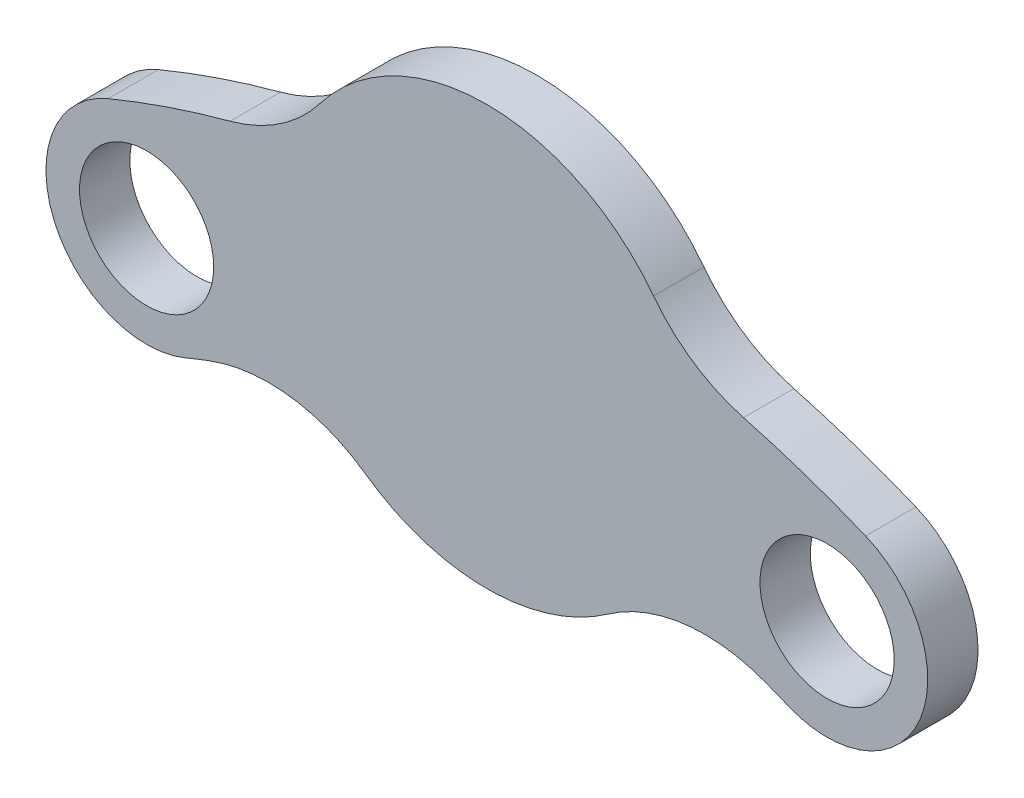
ISO-10303-21;
HEADER;
FILE_DESCRIPTION(('STEP AP214'),'2;1');
FILE_NAME('part.step','',(''),(''),'','','');
FILE_SCHEMA(('AUTOMOTIVE_DESIGN { 1 0 10303 214 1 1 1 1 }'));
ENDSEC;
DATA;
#1=APPLICATION_CONTEXT('core data for automotive mechanical design processes');
#2=APPLICATION_PROTOCOL_DEFINITION('international standard','automotive_design',2000,#1);
#3=PRODUCT_CONTEXT('',#1,'mechanical');
#4=PRODUCT('Part','Part','',(#3));
#5=PRODUCT_RELATED_PRODUCT_CATEGORY('part','',(#4));
#6=PRODUCT_DEFINITION_FORMATION('','',#4);
#7=PRODUCT_DEFINITION_CONTEXT('part definition',#1,'design');
#8=PRODUCT_DEFINITION('design','',#6,#7);
#9=PRODUCT_DEFINITION_SHAPE('','',#8);
#10=(LENGTH_UNIT() NAMED_UNIT(*) SI_UNIT(.MILLI.,.METRE.));
#11=(NAMED_UNIT(*) PLANE_ANGLE_UNIT() SI_UNIT($,.RADIAN.));
#12=(NAMED_UNIT(*) SI_UNIT($,.STERADIAN.) SOLID_ANGLE_UNIT());
#13=UNCERTAINTY_MEASURE_WITH_UNIT(LENGTH_MEASURE(1.E-05),#10,'distance_accuracy_value','');
#14=(GEOMETRIC_REPRESENTATION_CONTEXT(3) GLOBAL_UNCERTAINTY_ASSIGNED_CONTEXT((#13)) GLOBAL_UNIT_ASSIGNED_CONTEXT((#10,
#11,#12)) REPRESENTATION_CONTEXT('',''));
#15=CARTESIAN_POINT('',(0.,0.,0.));
#16=DIRECTION('',(0.,0.,1.));
#17=DIRECTION('',(1.,0.,0.));
#18=AXIS2_PLACEMENT_3D('',#15,#16,#17);
#19=CARTESIAN_POINT('',(0.,13.25,1.5));
#20=DIRECTION('',(0.,0.,1.));
#21=DIRECTION('',(1.,0.,0.));
#22=AXIS2_PLACEMENT_3D('',#19,#20,#21);
#23=PLANE('',#22);
#24=CARTESIAN_POINT('',(-10.1411109576752,24.4828076115472,1.5));
#25=DIRECTION('',(0.,0.,1.));
#26=DIRECTION('',(1.,0.,0.));
#27=AXIS2_PLACEMENT_3D('',#24,#25,#26);
#28=CIRCLE('',#27,2.);
#29=CARTESIAN_POINT('',(-8.14111095767523,24.4828076115472,1.5));
#30=VERTEX_POINT('',#29);
#31=EDGE_CURVE('E165',#30,#30,#28,.T.);
#32=ORIENTED_EDGE('',*,*,#31,.F.);
#33=EDGE_LOOP('',(#32));
#34=FACE_BOUND('',#33,.T.);
#35=CARTESIAN_POINT('',(0.,0.,1.5));
#36=DIRECTION('',(0.,0.,1.));
#37=DIRECTION('',(1.,0.,0.));
#38=AXIS2_PLACEMENT_3D('',#35,#36,#37);
#39=CIRCLE('',#38,29.4999999999983);
#40=CARTESIAN_POINT('',(11.2891612547697,27.2544462090831,1.5));
#41=VERTEX_POINT('',#40);
#42=CARTESIAN_POINT('',(7.65067171290921,28.4906514902905,1.5));
#43=VERTEX_POINT('',#42);
#44=EDGE_CURVE('E159',#41,#43,#39,.T.);
#45=ORIENTED_EDGE('',*,*,#44,.T.);
#46=CARTESIAN_POINT('',(8.94739573204644,33.319575471696,1.5));
#47=DIRECTION('',(0.,0.,1.));
#48=DIRECTION('',(1.,0.,0.));
#49=AXIS2_PLACEMENT_3D('',#46,#47,#48);
#50=CIRCLE('',#49,5.);
#51=CARTESIAN_POINT('',(4.97077540669247,30.2886530398311,1.5));
#52=VERTEX_POINT('',#51);
#53=EDGE_CURVE('E207',#43,#52,#50,.F.);
#54=ORIENTED_EDGE('',*,*,#53,.T.);
#55=CARTESIAN_POINT('',(0.,26.5,1.5));
#56=DIRECTION('',(0.,0.,1.));
#57=DIRECTION('',(1.,0.,0.));
#58=AXIS2_PLACEMENT_3D('',#55,#56,#57);
#59=CIRCLE('',#58,6.25);
#60=CARTESIAN_POINT('',(-4.97077540669246,30.2886530398311,1.5));
#61=VERTEX_POINT('',#60);
#62=EDGE_CURVE('E133',#52,#61,#59,.T.);
#63=ORIENTED_EDGE('',*,*,#62,.T.);
#64=CARTESIAN_POINT('',(-8.94739573204641,33.319575471696,1.5));
#65=DIRECTION('',(0.,0.,1.));
#66=DIRECTION('',(1.,0.,0.));
#67=AXIS2_PLACEMENT_3D('',#64,#65,#66);
#68=CIRCLE('',#67,5.);
#69=CARTESIAN_POINT('',(-7.65067171290919,28.4906514902905,1.5));
#70=VERTEX_POINT('',#69);
#71=EDGE_CURVE('E129',#61,#70,#68,.F.);
#72=ORIENTED_EDGE('',*,*,#71,.T.);
#73=CARTESIAN_POINT('',(0.,0.,1.5));
#74=DIRECTION('',(0.,0.,1.));
#75=DIRECTION('',(1.,0.,0.));
#76=AXIS2_PLACEMENT_3D('',#73,#74,#75);
#77=CIRCLE('',#76,29.4999999999983);
#78=CARTESIAN_POINT('',(-11.2891612547706,27.254446209081,1.5));
#79=VERTEX_POINT('',#78);
#80=EDGE_CURVE('E119',#70,#79,#77,.T.);
#81=ORIENTED_EDGE('',*,*,#80,.T.);
#82=CARTESIAN_POINT('',(-10.1411109576752,24.4828076115472,1.5));
#83=DIRECTION('',(0.,0.,1.));
#84=DIRECTION('',(1.,0.,0.));
#85=AXIS2_PLACEMENT_3D('',#82,#83,#84);
#86=CIRCLE('',#85,3.);
#87=CARTESIAN_POINT('',(-8.99306066057985,21.7111690140134,1.5));
#88=VERTEX_POINT('',#87);
#89=EDGE_CURVE('E125',#79,#88,#86,.T.);
#90=ORIENTED_EDGE('',*,*,#89,.T.);
#91=CARTESIAN_POINT('',(0.,0.,1.5));
#92=DIRECTION('',(0.,0.,-1.));
#93=DIRECTION('',(1.,0.,0.));
#94=AXIS2_PLACEMENT_3D('',#91,#92,#93);
#95=CIRCLE('',#94,23.4999999999983);
#96=CARTESIAN_POINT('',(-8.25991282210598,22.0005418153993,1.5));
#97=VERTEX_POINT('',#96);
#98=EDGE_CURVE('E148',#88,#97,#95,.T.);
#99=ORIENTED_EDGE('',*,*,#98,.T.);
#100=CARTESIAN_POINT('',(-6.50248456208331,17.319575471697,1.5));
#101=DIRECTION('',(0.,0.,1.));
#102=DIRECTION('',(1.,0.,0.));
#103=AXIS2_PLACEMENT_3D('',#100,#101,#102);
#104=CIRCLE('',#103,5.);
#105=CARTESIAN_POINT('',(-3.61249142337962,21.3997641509428,1.5));
#106=VERTEX_POINT('',#105);
#107=EDGE_CURVE('E214',#97,#106,#104,.F.);
#108=ORIENTED_EDGE('',*,*,#107,.T.);
#109=CARTESIAN_POINT('',(0.,26.5,1.5));
#110=DIRECTION('',(0.,0.,1.));
#111=DIRECTION('',(1.,0.,0.));
#112=AXIS2_PLACEMENT_3D('',#109,#110,#111);
#113=CIRCLE('',#112,6.25);
#114=CARTESIAN_POINT('',(3.61249142337962,21.3997641509428,1.5));
#115=VERTEX_POINT('',#114);
#116=EDGE_CURVE('E150',#106,#115,#113,.T.);
#117=ORIENTED_EDGE('',*,*,#116,.T.);
#118=CARTESIAN_POINT('',(6.50248456208331,17.319575471697,1.5));
#119=DIRECTION('',(0.,0.,1.));
#120=DIRECTION('',(1.,0.,0.));
#121=AXIS2_PLACEMENT_3D('',#118,#119,#120);
#122=CIRCLE('',#121,5.);
#123=CARTESIAN_POINT('',(8.25991282210598,22.0005418153993,1.5));
#124=VERTEX_POINT('',#123);
#125=EDGE_CURVE('E11',#115,#124,#122,.F.);
#126=ORIENTED_EDGE('',*,*,#125,.T.);
#127=CARTESIAN_POINT('',(0.,0.,1.5));
#128=DIRECTION('',(0.,0.,-1.));
#129=DIRECTION('',(1.,0.,0.));
#130=AXIS2_PLACEMENT_3D('',#127,#128,#129);
#131=CIRCLE('',#130,23.4999999999983);
#132=CARTESIAN_POINT('',(8.99306066057865,21.7111690140138,1.5));
#133=VERTEX_POINT('',#132);
#134=EDGE_CURVE('E155',#124,#133,#131,.T.);
#135=ORIENTED_EDGE('',*,*,#134,.T.);
#136=CARTESIAN_POINT('',(10.1411109576745,24.4828076115492,1.5));
#137=DIRECTION('',(0.,0.,1.));
#138=DIRECTION('',(1.,0.,0.));
#139=AXIS2_PLACEMENT_3D('',#136,#137,#138);
#140=CIRCLE('',#139,3.);
#141=EDGE_CURVE('E157',#133,#41,#140,.T.);
#142=ORIENTED_EDGE('',*,*,#141,.T.);
#143=EDGE_LOOP('',(#45,#54,#63,#72,#81,#90,#99,#108,#117,#126,#135,#142));
#144=FACE_BOUND('',#143,.T.);
#145=CARTESIAN_POINT('',(10.1411109576745,24.4828076115492,1.5));
#146=DIRECTION('',(0.,0.,1.));
#147=DIRECTION('',(1.,0.,0.));
#148=AXIS2_PLACEMENT_3D('',#145,#146,#147);
#149=CIRCLE('',#148,2.);
#150=CARTESIAN_POINT('',(12.1411109576745,24.4828076115492,1.5));
#151=VERTEX_POINT('',#150);
#152=EDGE_CURVE('E250',#151,#151,#149,.T.);
#153=ORIENTED_EDGE('',*,*,#152,.F.);
#154=EDGE_LOOP('',(#153));
#155=FACE_BOUND('',#154,.T.);
#156=ADVANCED_FACE('F33',(#34,#144,#155),#23,.T.);
#157=CARTESIAN_POINT('',(0.,13.25,0.));
#158=DIRECTION('',(0.,0.,1.));
#159=DIRECTION('',(1.,0.,0.));
#160=AXIS2_PLACEMENT_3D('',#157,#158,#159);
#161=PLANE('',#160);
#162=CARTESIAN_POINT('',(-10.1411109576752,24.4828076115472,0.));
#163=DIRECTION('',(0.,0.,1.));
#164=DIRECTION('',(1.,0.,0.));
#165=AXIS2_PLACEMENT_3D('',#162,#163,#164);
#166=CIRCLE('',#165,2.);
#167=CARTESIAN_POINT('',(-8.14111095767523,24.4828076115472,0.));
#168=VERTEX_POINT('',#167);
#169=EDGE_CURVE('E247',#168,#168,#166,.T.);
#170=ORIENTED_EDGE('',*,*,#169,.T.);
#171=EDGE_LOOP('',(#170));
#172=FACE_BOUND('',#171,.T.);
#173=CARTESIAN_POINT('',(0.,26.5,0.));
#174=DIRECTION('',(0.,0.,1.));
#175=DIRECTION('',(1.,0.,0.));
#176=AXIS2_PLACEMENT_3D('',#173,#174,#175);
#177=CIRCLE('',#176,6.25);
#178=CARTESIAN_POINT('',(4.97077540669247,30.2886530398311,0.));
#179=VERTEX_POINT('',#178);
#180=CARTESIAN_POINT('',(-4.97077540669246,30.2886530398311,0.));
#181=VERTEX_POINT('',#180);
#182=EDGE_CURVE('E162',#179,#181,#177,.T.);
#183=ORIENTED_EDGE('',*,*,#182,.F.);
#184=CARTESIAN_POINT('',(8.94739573204644,33.319575471696,0.));
#185=DIRECTION('',(0.,0.,1.));
#186=DIRECTION('',(1.,0.,0.));
#187=AXIS2_PLACEMENT_3D('',#184,#185,#186);
#188=CIRCLE('',#187,5.);
#189=CARTESIAN_POINT('',(7.65067171290921,28.4906514902905,0.));
#190=VERTEX_POINT('',#189);
#191=EDGE_CURVE('E205',#179,#190,#188,.T.);
#192=ORIENTED_EDGE('',*,*,#191,.T.);
#193=CARTESIAN_POINT('',(0.,0.,0.));
#194=DIRECTION('',(0.,0.,1.));
#195=DIRECTION('',(1.,0.,0.));
#196=AXIS2_PLACEMENT_3D('',#193,#194,#195);
#197=CIRCLE('',#196,29.4999999999983);
#198=CARTESIAN_POINT('',(11.2891612547697,27.2544462090831,0.));
#199=VERTEX_POINT('',#198);
#200=EDGE_CURVE('E179',#199,#190,#197,.T.);
#201=ORIENTED_EDGE('',*,*,#200,.F.);
#202=CARTESIAN_POINT('',(10.1411109576745,24.4828076115492,0.));
#203=DIRECTION('',(0.,0.,1.));
#204=DIRECTION('',(1.,0.,0.));
#205=AXIS2_PLACEMENT_3D('',#202,#203,#204);
#206=CIRCLE('',#205,3.);
#207=CARTESIAN_POINT('',(8.99306066057865,21.7111690140138,0.));
#208=VERTEX_POINT('',#207);
#209=EDGE_CURVE('E177',#208,#199,#206,.T.);
#210=ORIENTED_EDGE('',*,*,#209,.F.);
#211=CARTESIAN_POINT('',(0.,0.,0.));
#212=DIRECTION('',(0.,0.,-1.));
#213=DIRECTION('',(1.,0.,0.));
#214=AXIS2_PLACEMENT_3D('',#211,#212,#213);
#215=CIRCLE('',#214,23.4999999999983);
#216=CARTESIAN_POINT('',(8.25991282210598,22.0005418153993,0.));
#217=VERTEX_POINT('',#216);
#218=EDGE_CURVE('E175',#217,#208,#215,.T.);
#219=ORIENTED_EDGE('',*,*,#218,.F.);
#220=CARTESIAN_POINT('',(6.50248456208331,17.319575471697,0.));
#221=DIRECTION('',(0.,0.,1.));
#222=DIRECTION('',(1.,0.,0.));
#223=AXIS2_PLACEMENT_3D('',#220,#221,#222);
#224=CIRCLE('',#223,5.);
#225=CARTESIAN_POINT('',(3.61249142337962,21.3997641509428,0.));
#226=VERTEX_POINT('',#225);
#227=EDGE_CURVE('E41',#217,#226,#224,.T.);
#228=ORIENTED_EDGE('',*,*,#227,.T.);
#229=CARTESIAN_POINT('',(0.,26.5,0.));
#230=DIRECTION('',(0.,0.,1.));
#231=DIRECTION('',(1.,0.,0.));
#232=AXIS2_PLACEMENT_3D('',#229,#230,#231);
#233=CIRCLE('',#232,6.25);
#234=CARTESIAN_POINT('',(-3.61249142337962,21.3997641509428,0.));
#235=VERTEX_POINT('',#234);
#236=EDGE_CURVE('E172',#235,#226,#233,.T.);
#237=ORIENTED_EDGE('',*,*,#236,.F.);
#238=CARTESIAN_POINT('',(-6.50248456208331,17.319575471697,0.));
#239=DIRECTION('',(0.,0.,1.));
#240=DIRECTION('',(1.,0.,0.));
#241=AXIS2_PLACEMENT_3D('',#238,#239,#240);
#242=CIRCLE('',#241,5.);
#243=CARTESIAN_POINT('',(-8.25991282210598,22.0005418153993,0.));
#244=VERTEX_POINT('',#243);
#245=EDGE_CURVE('E212',#235,#244,#242,.T.);
#246=ORIENTED_EDGE('',*,*,#245,.T.);
#247=CARTESIAN_POINT('',(0.,0.,0.));
#248=DIRECTION('',(0.,0.,-1.));
#249=DIRECTION('',(1.,0.,0.));
#250=AXIS2_PLACEMENT_3D('',#247,#248,#249);
#251=CIRCLE('',#250,23.4999999999983);
#252=CARTESIAN_POINT('',(-8.99306066057985,21.7111690140134,0.));
#253=VERTEX_POINT('',#252);
#254=EDGE_CURVE('E169',#253,#244,#251,.T.);
#255=ORIENTED_EDGE('',*,*,#254,.F.);
#256=CARTESIAN_POINT('',(-10.1411109576752,24.4828076115472,0.));
#257=DIRECTION('',(0.,0.,1.));
#258=DIRECTION('',(1.,0.,0.));
#259=AXIS2_PLACEMENT_3D('',#256,#257,#258);
#260=CIRCLE('',#259,3.);
#261=CARTESIAN_POINT('',(-11.2891612547706,27.254446209081,0.));
#262=VERTEX_POINT('',#261);
#263=EDGE_CURVE('E167',#262,#253,#260,.T.);
#264=ORIENTED_EDGE('',*,*,#263,.F.);
#265=CARTESIAN_POINT('',(0.,0.,0.));
#266=DIRECTION('',(0.,0.,1.));
#267=DIRECTION('',(1.,0.,0.));
#268=AXIS2_PLACEMENT_3D('',#265,#266,#267);
#269=CIRCLE('',#268,29.4999999999983);
#270=CARTESIAN_POINT('',(-7.65067171290919,28.4906514902905,0.));
#271=VERTEX_POINT('',#270);
#272=EDGE_CURVE('E139',#271,#262,#269,.T.);
#273=ORIENTED_EDGE('',*,*,#272,.F.);
#274=CARTESIAN_POINT('',(-8.94739573204641,33.319575471696,0.));
#275=DIRECTION('',(0.,0.,1.));
#276=DIRECTION('',(1.,0.,0.));
#277=AXIS2_PLACEMENT_3D('',#274,#275,#276);
#278=CIRCLE('',#277,5.);
#279=EDGE_CURVE('E209',#271,#181,#278,.T.);
#280=ORIENTED_EDGE('',*,*,#279,.T.);
#281=EDGE_LOOP('',(#183,#192,#201,#210,#219,#228,#237,#246,#255,#264,#273,#280));
#282=FACE_BOUND('',#281,.T.);
#283=CARTESIAN_POINT('',(10.1411109576745,24.4828076115492,0.));
#284=DIRECTION('',(0.,0.,1.));
#285=DIRECTION('',(1.,0.,0.));
#286=AXIS2_PLACEMENT_3D('',#283,#284,#285);
#287=CIRCLE('',#286,2.);
#288=CARTESIAN_POINT('',(12.1411109576745,24.4828076115492,0.));
#289=VERTEX_POINT('',#288);
#290=EDGE_CURVE('E253',#289,#289,#287,.T.);
#291=ORIENTED_EDGE('',*,*,#290,.T.);
#292=EDGE_LOOP('',(#291));
#293=FACE_BOUND('',#292,.T.);
#294=ADVANCED_FACE('F219',(#172,#282,#293),#161,.F.);
#295=CARTESIAN_POINT('',(0.,26.5,1.5));
#296=DIRECTION('',(0.,0.,-1.));
#297=DIRECTION('',(-1.,0.,0.));
#298=AXIS2_PLACEMENT_3D('',#295,#296,#297);
#299=CYLINDRICAL_SURFACE('',#298,6.25);
#300=ORIENTED_EDGE('',*,*,#62,.F.);
#301=DIRECTION('',(0.,0.,-1.));
#302=VECTOR('',#301,1.);
#303=CARTESIAN_POINT('',(4.97077540669247,30.2886530398311,1.5));
#304=LINE('',#303,#302);
#305=EDGE_CURVE('E189',#52,#179,#304,.T.);
#306=ORIENTED_EDGE('',*,*,#305,.T.);
#307=ORIENTED_EDGE('',*,*,#182,.T.);
#308=DIRECTION('',(0.,0.,-1.));
#309=VECTOR('',#308,1.);
#310=CARTESIAN_POINT('',(-4.97077540669246,30.2886530398311,1.5));
#311=LINE('',#310,#309);
#312=EDGE_CURVE('E142',#181,#61,#311,.F.);
#313=ORIENTED_EDGE('',*,*,#312,.T.);
#314=EDGE_LOOP('',(#300,#306,#307,#313));
#315=FACE_BOUND('',#314,.T.);
#316=ADVANCED_FACE('F244',(#315),#299,.T.);
#317=CARTESIAN_POINT('',(0.,0.,1.5));
#318=DIRECTION('',(0.,0.,-1.));
#319=DIRECTION('',(-1.,0.,0.));
#320=AXIS2_PLACEMENT_3D('',#317,#318,#319);
#321=CYLINDRICAL_SURFACE('',#320,29.4999999999983);
#322=ORIENTED_EDGE('',*,*,#80,.F.);
#323=DIRECTION('',(0.,0.,-1.));
#324=VECTOR('',#323,1.);
#325=CARTESIAN_POINT('',(-7.65067171290919,28.4906514902905,1.5));
#326=LINE('',#325,#324);
#327=EDGE_CURVE('E194',#70,#271,#326,.T.);
#328=ORIENTED_EDGE('',*,*,#327,.T.);
#329=ORIENTED_EDGE('',*,*,#272,.T.);
#330=DIRECTION('',(0.,0.,-1.));
#331=VECTOR('',#330,1.);
#332=CARTESIAN_POINT('',(-11.2891612547706,27.254446209081,1.5));
#333=LINE('',#332,#331);
#334=EDGE_CURVE('E136',#79,#262,#333,.T.);
#335=ORIENTED_EDGE('',*,*,#334,.F.);
#336=EDGE_LOOP('',(#322,#328,#329,#335));
#337=FACE_BOUND('',#336,.T.);
#338=ADVANCED_FACE('F137',(#337),#321,.T.);
#339=CARTESIAN_POINT('',(-10.1411109576752,24.4828076115472,1.5));
#340=DIRECTION('',(0.,0.,-1.));
#341=DIRECTION('',(-1.,0.,0.));
#342=AXIS2_PLACEMENT_3D('',#339,#340,#341);
#343=CYLINDRICAL_SURFACE('',#342,3.);
#344=ORIENTED_EDGE('',*,*,#263,.T.);
#345=DIRECTION('',(0.,0.,-1.));
#346=VECTOR('',#345,1.);
#347=CARTESIAN_POINT('',(-8.99306066057985,21.7111690140134,1.5));
#348=LINE('',#347,#346);
#349=EDGE_CURVE('E143',#88,#253,#348,.T.);
#350=ORIENTED_EDGE('',*,*,#349,.F.);
#351=ORIENTED_EDGE('',*,*,#89,.F.);
#352=ORIENTED_EDGE('',*,*,#334,.T.);
#353=EDGE_LOOP('',(#344,#350,#351,#352));
#354=FACE_BOUND('',#353,.T.);
#355=ADVANCED_FACE('F145',(#354),#343,.T.);
#356=CARTESIAN_POINT('',(0.,0.,1.5));
#357=DIRECTION('',(0.,0.,-1.));
#358=DIRECTION('',(-1.,0.,0.));
#359=AXIS2_PLACEMENT_3D('',#356,#357,#358);
#360=CYLINDRICAL_SURFACE('',#359,23.4999999999983);
#361=ORIENTED_EDGE('',*,*,#254,.T.);
#362=DIRECTION('',(0.,0.,-1.));
#363=VECTOR('',#362,1.);
#364=CARTESIAN_POINT('',(-8.25991282210598,22.0005418153993,1.5));
#365=LINE('',#364,#363);
#366=EDGE_CURVE('E201',#244,#97,#365,.F.);
#367=ORIENTED_EDGE('',*,*,#366,.T.);
#368=ORIENTED_EDGE('',*,*,#98,.F.);
#369=ORIENTED_EDGE('',*,*,#349,.T.);
#370=EDGE_LOOP('',(#361,#367,#368,#369));
#371=FACE_BOUND('',#370,.T.);
#372=ADVANCED_FACE('F282',(#371),#360,.F.);
#373=CARTESIAN_POINT('',(0.,26.5,1.5));
#374=DIRECTION('',(0.,0.,-1.));
#375=DIRECTION('',(-1.,0.,0.));
#376=AXIS2_PLACEMENT_3D('',#373,#374,#375);
#377=CYLINDRICAL_SURFACE('',#376,6.25);
#378=ORIENTED_EDGE('',*,*,#116,.F.);
#379=DIRECTION('',(0.,0.,-1.));
#380=VECTOR('',#379,1.);
#381=CARTESIAN_POINT('',(-3.61249142337962,21.3997641509428,1.5));
#382=LINE('',#381,#380);
#383=EDGE_CURVE('E198',#106,#235,#382,.T.);
#384=ORIENTED_EDGE('',*,*,#383,.T.);
#385=ORIENTED_EDGE('',*,*,#236,.T.);
#386=DIRECTION('',(0.,0.,-1.));
#387=VECTOR('',#386,1.);
#388=CARTESIAN_POINT('',(3.61249142337962,21.3997641509428,1.5));
#389=LINE('',#388,#387);
#390=EDGE_CURVE('E196',#226,#115,#389,.F.);
#391=ORIENTED_EDGE('',*,*,#390,.T.);
#392=EDGE_LOOP('',(#378,#384,#385,#391));
#393=FACE_BOUND('',#392,.T.);
#394=ADVANCED_FACE('F224',(#393),#377,.T.);
#395=CARTESIAN_POINT('',(0.,0.,1.5));
#396=DIRECTION('',(0.,0.,-1.));
#397=DIRECTION('',(-1.,0.,0.));
#398=AXIS2_PLACEMENT_3D('',#395,#396,#397);
#399=CYLINDRICAL_SURFACE('',#398,23.4999999999983);
#400=ORIENTED_EDGE('',*,*,#134,.F.);
#401=DIRECTION('',(0.,0.,-1.));
#402=VECTOR('',#401,1.);
#403=CARTESIAN_POINT('',(8.25991282210598,22.0005418153993,1.5));
#404=LINE('',#403,#402);
#405=EDGE_CURVE('E203',#124,#217,#404,.T.);
#406=ORIENTED_EDGE('',*,*,#405,.T.);
#407=ORIENTED_EDGE('',*,*,#218,.T.);
#408=DIRECTION('',(0.,0.,-1.));
#409=VECTOR('',#408,1.);
#410=CARTESIAN_POINT('',(8.99306066057865,21.7111690140138,1.5));
#411=LINE('',#410,#409);
#412=EDGE_CURVE('E184',#133,#208,#411,.T.);
#413=ORIENTED_EDGE('',*,*,#412,.F.);
#414=EDGE_LOOP('',(#400,#406,#407,#413));
#415=FACE_BOUND('',#414,.T.);
#416=ADVANCED_FACE('F227',(#415),#399,.F.);
#417=CARTESIAN_POINT('',(10.1411109576745,24.4828076115492,1.5));
#418=DIRECTION('',(0.,0.,-1.));
#419=DIRECTION('',(-1.,0.,0.));
#420=AXIS2_PLACEMENT_3D('',#417,#418,#419);
#421=CYLINDRICAL_SURFACE('',#420,3.);
#422=ORIENTED_EDGE('',*,*,#209,.T.);
#423=DIRECTION('',(0.,0.,-1.));
#424=VECTOR('',#423,1.);
#425=CARTESIAN_POINT('',(11.2891612547697,27.2544462090831,1.5));
#426=LINE('',#425,#424);
#427=EDGE_CURVE('E161',#41,#199,#426,.T.);
#428=ORIENTED_EDGE('',*,*,#427,.F.);
#429=ORIENTED_EDGE('',*,*,#141,.F.);
#430=ORIENTED_EDGE('',*,*,#412,.T.);
#431=EDGE_LOOP('',(#422,#428,#429,#430));
#432=FACE_BOUND('',#431,.T.);
#433=ADVANCED_FACE('F234',(#432),#421,.T.);
#434=CARTESIAN_POINT('',(0.,0.,1.5));
#435=DIRECTION('',(0.,0.,-1.));
#436=DIRECTION('',(-1.,0.,0.));
#437=AXIS2_PLACEMENT_3D('',#434,#435,#436);
#438=CYLINDRICAL_SURFACE('',#437,29.4999999999983);
#439=ORIENTED_EDGE('',*,*,#200,.T.);
#440=DIRECTION('',(0.,0.,-1.));
#441=VECTOR('',#440,1.);
#442=CARTESIAN_POINT('',(7.65067171290921,28.4906514902905,1.5));
#443=LINE('',#442,#441);
#444=EDGE_CURVE('E192',#190,#43,#443,.F.);
#445=ORIENTED_EDGE('',*,*,#444,.T.);
#446=ORIENTED_EDGE('',*,*,#44,.F.);
#447=ORIENTED_EDGE('',*,*,#427,.T.);
#448=EDGE_LOOP('',(#439,#445,#446,#447));
#449=FACE_BOUND('',#448,.T.);
#450=ADVANCED_FACE('F237',(#449),#438,.T.);
#451=CARTESIAN_POINT('',(-10.1411109576752,24.4828076115472,1.5));
#452=DIRECTION('',(0.,0.,-1.));
#453=DIRECTION('',(-1.,0.,0.));
#454=AXIS2_PLACEMENT_3D('',#451,#452,#453);
#455=CYLINDRICAL_SURFACE('',#454,2.);
#456=ORIENTED_EDGE('',*,*,#31,.T.);
#457=EDGE_LOOP('',(#456));
#458=FACE_BOUND('',#457,.T.);
#459=ORIENTED_EDGE('',*,*,#169,.F.);
#460=EDGE_LOOP('',(#459));
#461=FACE_BOUND('',#460,.T.);
#462=ADVANCED_FACE('F271',(#458,#461),#455,.F.);
#463=CARTESIAN_POINT('',(10.1411109576745,24.4828076115492,1.5));
#464=DIRECTION('',(0.,0.,-1.));
#465=DIRECTION('',(-1.,0.,0.));
#466=AXIS2_PLACEMENT_3D('',#463,#464,#465);
#467=CYLINDRICAL_SURFACE('',#466,2.);
#468=ORIENTED_EDGE('',*,*,#152,.T.);
#469=EDGE_LOOP('',(#468));
#470=FACE_BOUND('',#469,.T.);
#471=ORIENTED_EDGE('',*,*,#290,.F.);
#472=EDGE_LOOP('',(#471));
#473=FACE_BOUND('',#472,.T.);
#474=ADVANCED_FACE('F259',(#470,#473),#467,.F.);
#475=CARTESIAN_POINT('',(8.94739573204644,33.319575471696,1.5));
#476=DIRECTION('',(0.,0.,1.));
#477=DIRECTION('',(1.,0.,0.));
#478=AXIS2_PLACEMENT_3D('',#475,#476,#477);
#479=CYLINDRICAL_SURFACE('',#478,5.);
#480=ORIENTED_EDGE('',*,*,#53,.F.);
#481=ORIENTED_EDGE('',*,*,#444,.F.);
#482=ORIENTED_EDGE('',*,*,#191,.F.);
#483=ORIENTED_EDGE('',*,*,#305,.F.);
#484=EDGE_LOOP('',(#480,#481,#482,#483));
#485=FACE_BOUND('',#484,.T.);
#486=ADVANCED_FACE('F240',(#485),#479,.F.);
#487=CARTESIAN_POINT('',(-8.94739573204641,33.319575471696,1.5));
#488=DIRECTION('',(0.,0.,1.));
#489=DIRECTION('',(1.,0.,0.));
#490=AXIS2_PLACEMENT_3D('',#487,#488,#489);
#491=CYLINDRICAL_SURFACE('',#490,5.);
#492=ORIENTED_EDGE('',*,*,#71,.F.);
#493=ORIENTED_EDGE('',*,*,#312,.F.);
#494=ORIENTED_EDGE('',*,*,#279,.F.);
#495=ORIENTED_EDGE('',*,*,#327,.F.);
#496=EDGE_LOOP('',(#492,#493,#494,#495));
#497=FACE_BOUND('',#496,.T.);
#498=ADVANCED_FACE('F294',(#497),#491,.F.);
#499=CARTESIAN_POINT('',(-6.50248456208331,17.319575471697,1.5));
#500=DIRECTION('',(0.,0.,-1.));
#501=DIRECTION('',(-1.,0.,0.));
#502=AXIS2_PLACEMENT_3D('',#499,#500,#501);
#503=CYLINDRICAL_SURFACE('',#502,5.);
#504=ORIENTED_EDGE('',*,*,#107,.F.);
#505=ORIENTED_EDGE('',*,*,#366,.F.);
#506=ORIENTED_EDGE('',*,*,#245,.F.);
#507=ORIENTED_EDGE('',*,*,#383,.F.);
#508=EDGE_LOOP('',(#504,#505,#506,#507));
#509=FACE_BOUND('',#508,.T.);
#510=ADVANCED_FACE('F296',(#509),#503,.F.);
#511=CARTESIAN_POINT('',(6.50248456208331,17.319575471697,1.5));
#512=DIRECTION('',(0.,0.,-1.));
#513=DIRECTION('',(-1.,0.,0.));
#514=AXIS2_PLACEMENT_3D('',#511,#512,#513);
#515=CYLINDRICAL_SURFACE('',#514,5.);
#516=ORIENTED_EDGE('',*,*,#125,.F.);
#517=ORIENTED_EDGE('',*,*,#390,.F.);
#518=ORIENTED_EDGE('',*,*,#227,.F.);
#519=ORIENTED_EDGE('',*,*,#405,.F.);
#520=EDGE_LOOP('',(#516,#517,#518,#519));
#521=FACE_BOUND('',#520,.T.);
#522=ADVANCED_FACE('F35',(#521),#515,.F.);
#523=CLOSED_SHELL('',(#156,#294,#316,#338,#355,#372,#394,#416,#433,#450,#462,#474,#486,#498,
#510,#522));
#524=MANIFOLD_SOLID_BREP('B2',#523);
#525=ADVANCED_BREP_SHAPE_REPRESENTATION('',(#18,#524),#14);
#526=SHAPE_DEFINITION_REPRESENTATION(#9,#525);
ENDSEC;
END-ISO-10303-21;
